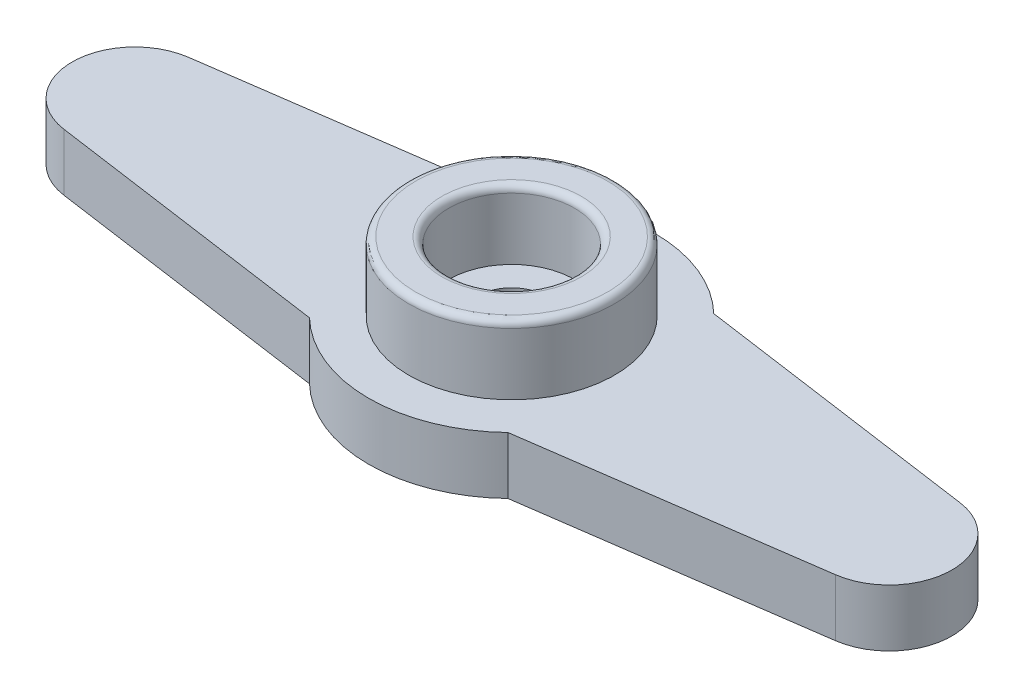
ISO-10303-21;
HEADER;
FILE_DESCRIPTION(('STEP AP214'),'2;1');
FILE_NAME('part.step','',(''),(''),'','','');
FILE_SCHEMA(('AUTOMOTIVE_DESIGN { 1 0 10303 214 1 1 1 1 }'));
ENDSEC;
DATA;
#1=APPLICATION_CONTEXT('core data for automotive mechanical design processes');
#2=APPLICATION_PROTOCOL_DEFINITION('international standard','automotive_design',2000,#1);
#3=PRODUCT_CONTEXT('',#1,'mechanical');
#4=PRODUCT('Part','Part','',(#3));
#5=PRODUCT_RELATED_PRODUCT_CATEGORY('part','',(#4));
#6=PRODUCT_DEFINITION_FORMATION('','',#4);
#7=PRODUCT_DEFINITION_CONTEXT('part definition',#1,'design');
#8=PRODUCT_DEFINITION('design','',#6,#7);
#9=PRODUCT_DEFINITION_SHAPE('','',#8);
#10=(LENGTH_UNIT() NAMED_UNIT(*) SI_UNIT(.MILLI.,.METRE.));
#11=(NAMED_UNIT(*) PLANE_ANGLE_UNIT() SI_UNIT($,.RADIAN.));
#12=(NAMED_UNIT(*) SI_UNIT($,.STERADIAN.) SOLID_ANGLE_UNIT());
#13=UNCERTAINTY_MEASURE_WITH_UNIT(LENGTH_MEASURE(1.E-05),#10,'distance_accuracy_value','');
#14=(GEOMETRIC_REPRESENTATION_CONTEXT(3) GLOBAL_UNCERTAINTY_ASSIGNED_CONTEXT((#13)) GLOBAL_UNIT_ASSIGNED_CONTEXT((#10,
#11,#12)) REPRESENTATION_CONTEXT('',''));
#15=CARTESIAN_POINT('',(0.,0.,0.));
#16=DIRECTION('',(0.,0.,1.));
#17=DIRECTION('',(1.,0.,0.));
#18=AXIS2_PLACEMENT_3D('',#15,#16,#17);
#19=CARTESIAN_POINT('',(16.5,0.,0.));
#20=DIRECTION('',(0.,1.,0.));
#21=DIRECTION('',(0.,0.,1.));
#22=AXIS2_PLACEMENT_3D('',#19,#20,#21);
#23=PLANE('',#22);
#24=CARTESIAN_POINT('',(0.,0.,0.));
#25=DIRECTION('',(0.,1.,0.));
#26=DIRECTION('',(0.,0.,1.));
#27=AXIS2_PLACEMENT_3D('',#24,#25,#26);
#28=CIRCLE('',#27,3.1);
#29=CARTESIAN_POINT('',(0.,0.,3.1));
#30=VERTEX_POINT('',#29);
#31=EDGE_CURVE('E184',#30,#30,#28,.T.);
#32=ORIENTED_EDGE('',*,*,#31,.T.);
#33=EDGE_LOOP('',(#32));
#34=FACE_BOUND('',#33,.T.);
#35=CARTESIAN_POINT('',(0.,0.,0.));
#36=DIRECTION('',(0.,1.,0.));
#37=DIRECTION('',(0.,0.,1.));
#38=AXIS2_PLACEMENT_3D('',#35,#36,#37);
#39=CIRCLE('',#38,3.2);
#40=CARTESIAN_POINT('',(0.,0.,3.2));
#41=VERTEX_POINT('',#40);
#42=EDGE_CURVE('E181',#41,#41,#39,.F.);
#43=ORIENTED_EDGE('',*,*,#42,.T.);
#44=EDGE_LOOP('',(#43));
#45=FACE_BOUND('',#44,.T.);
#46=ADVANCED_FACE('F35',(#34,#45),#23,.F.);
#47=CARTESIAN_POINT('',(16.5,2.5,0.));
#48=DIRECTION('',(0.,1.,0.));
#49=DIRECTION('',(0.,0.,1.));
#50=AXIS2_PLACEMENT_3D('',#47,#48,#49);
#51=PLANE('',#50);
#52=CARTESIAN_POINT('',(16.5,2.5,0.));
#53=DIRECTION('',(0.,1.,0.));
#54=DIRECTION('',(0.,0.,1.));
#55=AXIS2_PLACEMENT_3D('',#52,#53,#54);
#56=CIRCLE('',#55,2.75);
#57=CARTESIAN_POINT('',(16.8856250223403,2.5,2.72282818814281));
#58=VERTEX_POINT('',#57);
#59=CARTESIAN_POINT('',(16.8856250223403,2.5,-2.72282818814281));
#60=VERTEX_POINT('',#59);
#61=EDGE_CURVE('E149',#58,#60,#56,.T.);
#62=ORIENTED_EDGE('',*,*,#61,.T.);
#63=DIRECTION('',(-0.99011934114284,0.,-0.140227280851011));
#64=VECTOR('',#63,1.);
#65=CARTESIAN_POINT('',(16.8856250223403,2.5,-2.72282818814281));
#66=LINE('',#65,#64);
#67=CARTESIAN_POINT('',(4.33733789322437,2.5,-4.5));
#68=VERTEX_POINT('',#67);
#69=EDGE_CURVE('E96',#60,#68,#66,.T.);
#70=ORIENTED_EDGE('',*,*,#69,.T.);
#71=CARTESIAN_POINT('',(0.,2.5,0.));
#72=DIRECTION('',(0.,1.,0.));
#73=DIRECTION('',(0.,0.,1.));
#74=AXIS2_PLACEMENT_3D('',#71,#72,#73);
#75=CIRCLE('',#74,6.25);
#76=CARTESIAN_POINT('',(-4.34263185422694,2.5,-4.49489138674712));
#77=VERTEX_POINT('',#76);
#78=EDGE_CURVE('E253',#68,#77,#75,.T.);
#79=ORIENTED_EDGE('',*,*,#78,.T.);
#80=DIRECTION('',(-0.99011934114284,0.,0.140227280851011));
#81=VECTOR('',#80,1.);
#82=CARTESIAN_POINT('',(-16.8548479937508,2.5,-2.72282818814281));
#83=LINE('',#82,#81);
#84=CARTESIAN_POINT('',(-16.8548479937508,2.5,-2.72282818814281));
#85=VERTEX_POINT('',#84);
#86=EDGE_CURVE('E259',#77,#85,#83,.T.);
#87=ORIENTED_EDGE('',*,*,#86,.T.);
#88=CARTESIAN_POINT('',(-16.4692229714106,2.5,0.));
#89=DIRECTION('',(0.,1.,0.));
#90=DIRECTION('',(0.,0.,1.));
#91=AXIS2_PLACEMENT_3D('',#88,#89,#90);
#92=CIRCLE('',#91,2.75);
#93=CARTESIAN_POINT('',(-16.8548479937508,2.5,2.72282818814281));
#94=VERTEX_POINT('',#93);
#95=EDGE_CURVE('E116',#85,#94,#92,.T.);
#96=ORIENTED_EDGE('',*,*,#95,.T.);
#97=DIRECTION('',(0.99011934114284,0.,0.140227280851011));
#98=VECTOR('',#97,1.);
#99=CARTESIAN_POINT('',(-16.8548479937508,2.5,2.72282818814281));
#100=LINE('',#99,#98);
#101=CARTESIAN_POINT('',(-4.34263185422694,2.5,4.49489138674712));
#102=VERTEX_POINT('',#101);
#103=EDGE_CURVE('E109',#94,#102,#100,.T.);
#104=ORIENTED_EDGE('',*,*,#103,.T.);
#105=CARTESIAN_POINT('',(0.,2.5,0.));
#106=DIRECTION('',(0.,1.,0.));
#107=DIRECTION('',(0.,0.,1.));
#108=AXIS2_PLACEMENT_3D('',#105,#106,#107);
#109=CIRCLE('',#108,6.25);
#110=CARTESIAN_POINT('',(4.33733789322437,2.5,4.5));
#111=VERTEX_POINT('',#110);
#112=EDGE_CURVE('E114',#102,#111,#109,.T.);
#113=ORIENTED_EDGE('',*,*,#112,.T.);
#114=DIRECTION('',(0.99011934114284,0.,-0.140227280851011));
#115=VECTOR('',#114,1.);
#116=CARTESIAN_POINT('',(16.8856250223403,2.5,2.72282818814281));
#117=LINE('',#116,#115);
#118=EDGE_CURVE('E52',#111,#58,#117,.T.);
#119=ORIENTED_EDGE('',*,*,#118,.T.);
#120=EDGE_LOOP('',(#62,#70,#79,#87,#96,#104,#113,#119));
#121=FACE_BOUND('',#120,.T.);
#122=CARTESIAN_POINT('',(0.,2.5,0.));
#123=DIRECTION('',(0.,1.,0.));
#124=DIRECTION('',(0.,0.,1.));
#125=AXIS2_PLACEMENT_3D('',#122,#123,#124);
#126=CIRCLE('',#125,4.5);
#127=CARTESIAN_POINT('',(0.,2.5,4.5));
#128=VERTEX_POINT('',#127);
#129=EDGE_CURVE('E138',#128,#128,#126,.T.);
#130=ORIENTED_EDGE('',*,*,#129,.F.);
#131=EDGE_LOOP('',(#130));
#132=FACE_BOUND('',#131,.T.);
#133=ADVANCED_FACE('F111',(#121,#132),#51,.T.);
#134=CARTESIAN_POINT('',(16.5,2.5,0.));
#135=DIRECTION('',(0.,-1.,0.));
#136=DIRECTION('',(0.,0.,-1.));
#137=AXIS2_PLACEMENT_3D('',#134,#135,#136);
#138=CYLINDRICAL_SURFACE('',#137,2.75);
#139=CARTESIAN_POINT('',(16.5,0.,0.));
#140=DIRECTION('',(0.,1.,0.));
#141=DIRECTION('',(0.,0.,1.));
#142=AXIS2_PLACEMENT_3D('',#139,#140,#141);
#143=CIRCLE('',#142,2.75);
#144=CARTESIAN_POINT('',(16.8856250223403,0.,2.72282818814281));
#145=VERTEX_POINT('',#144);
#146=CARTESIAN_POINT('',(16.8856250223403,0.,-2.72282818814281));
#147=VERTEX_POINT('',#146);
#148=EDGE_CURVE('E134',#145,#147,#143,.T.);
#149=ORIENTED_EDGE('',*,*,#148,.T.);
#150=DIRECTION('',(0.,-1.,0.));
#151=VECTOR('',#150,1.);
#152=CARTESIAN_POINT('',(16.8856250223403,2.5,-2.72282818814281));
#153=LINE('',#152,#151);
#154=EDGE_CURVE('E162',#60,#147,#153,.T.);
#155=ORIENTED_EDGE('',*,*,#154,.F.);
#156=ORIENTED_EDGE('',*,*,#61,.F.);
#157=DIRECTION('',(0.,-1.,0.));
#158=VECTOR('',#157,1.);
#159=CARTESIAN_POINT('',(16.8856250223403,2.5,2.72282818814281));
#160=LINE('',#159,#158);
#161=EDGE_CURVE('E130',#58,#145,#160,.T.);
#162=ORIENTED_EDGE('',*,*,#161,.T.);
#163=EDGE_LOOP('',(#149,#155,#156,#162));
#164=FACE_BOUND('',#163,.T.);
#165=ADVANCED_FACE('F229',(#164),#138,.T.);
#166=CARTESIAN_POINT('',(16.8856250223403,2.5,-2.72282818814281));
#167=DIRECTION('',(-0.140227280851011,0.,0.99011934114284));
#168=DIRECTION('',(0.99011934114284,0.,0.140227280851011));
#169=AXIS2_PLACEMENT_3D('',#166,#167,#168);
#170=PLANE('',#169);
#171=DIRECTION('',(-0.99011934114284,0.,-0.140227280851011));
#172=VECTOR('',#171,1.);
#173=CARTESIAN_POINT('',(16.8856250223403,0.,-2.72282818814281));
#174=LINE('',#173,#172);
#175=CARTESIAN_POINT('',(4.33733789322437,0.,-4.5));
#176=VERTEX_POINT('',#175);
#177=EDGE_CURVE('E137',#147,#176,#174,.T.);
#178=ORIENTED_EDGE('',*,*,#177,.T.);
#179=DIRECTION('',(0.,-1.,0.));
#180=VECTOR('',#179,1.);
#181=CARTESIAN_POINT('',(4.33733789322437,2.5,-4.5));
#182=LINE('',#181,#180);
#183=EDGE_CURVE('E159',#68,#176,#182,.T.);
#184=ORIENTED_EDGE('',*,*,#183,.F.);
#185=ORIENTED_EDGE('',*,*,#69,.F.);
#186=ORIENTED_EDGE('',*,*,#154,.T.);
#187=EDGE_LOOP('',(#178,#184,#185,#186));
#188=FACE_BOUND('',#187,.T.);
#189=ADVANCED_FACE('F272',(#188),#170,.F.);
#190=CARTESIAN_POINT('',(0.,2.5,0.));
#191=DIRECTION('',(0.,-1.,0.));
#192=DIRECTION('',(0.,0.,-1.));
#193=AXIS2_PLACEMENT_3D('',#190,#191,#192);
#194=CYLINDRICAL_SURFACE('',#193,6.25);
#195=CARTESIAN_POINT('',(0.,0.,0.));
#196=DIRECTION('',(0.,1.,0.));
#197=DIRECTION('',(0.,0.,1.));
#198=AXIS2_PLACEMENT_3D('',#195,#196,#197);
#199=CIRCLE('',#198,6.25);
#200=CARTESIAN_POINT('',(-4.34263185422694,0.,-4.49489138674712));
#201=VERTEX_POINT('',#200);
#202=EDGE_CURVE('E140',#176,#201,#199,.T.);
#203=ORIENTED_EDGE('',*,*,#202,.T.);
#204=DIRECTION('',(0.,-1.,0.));
#205=VECTOR('',#204,1.);
#206=CARTESIAN_POINT('',(-4.34263185422694,2.5,-4.49489138674712));
#207=LINE('',#206,#205);
#208=EDGE_CURVE('E156',#77,#201,#207,.T.);
#209=ORIENTED_EDGE('',*,*,#208,.F.);
#210=ORIENTED_EDGE('',*,*,#78,.F.);
#211=ORIENTED_EDGE('',*,*,#183,.T.);
#212=EDGE_LOOP('',(#203,#209,#210,#211));
#213=FACE_BOUND('',#212,.T.);
#214=ADVANCED_FACE('F271',(#213),#194,.T.);
#215=CARTESIAN_POINT('',(-16.8548479937508,2.5,-2.72282818814281));
#216=DIRECTION('',(0.140227280851011,0.,0.99011934114284));
#217=DIRECTION('',(0.99011934114284,0.,-0.140227280851011));
#218=AXIS2_PLACEMENT_3D('',#215,#216,#217);
#219=PLANE('',#218);
#220=DIRECTION('',(-0.99011934114284,0.,0.140227280851011));
#221=VECTOR('',#220,1.);
#222=CARTESIAN_POINT('',(-16.8548479937508,0.,-2.72282818814281));
#223=LINE('',#222,#221);
#224=CARTESIAN_POINT('',(-16.8548479937508,0.,-2.72282818814281));
#225=VERTEX_POINT('',#224);
#226=EDGE_CURVE('E142',#201,#225,#223,.T.);
#227=ORIENTED_EDGE('',*,*,#226,.T.);
#228=DIRECTION('',(0.,-1.,0.));
#229=VECTOR('',#228,1.);
#230=CARTESIAN_POINT('',(-16.8548479937508,2.5,-2.72282818814281));
#231=LINE('',#230,#229);
#232=EDGE_CURVE('E153',#85,#225,#231,.T.);
#233=ORIENTED_EDGE('',*,*,#232,.F.);
#234=ORIENTED_EDGE('',*,*,#86,.F.);
#235=ORIENTED_EDGE('',*,*,#208,.T.);
#236=EDGE_LOOP('',(#227,#233,#234,#235));
#237=FACE_BOUND('',#236,.T.);
#238=ADVANCED_FACE('F265',(#237),#219,.F.);
#239=CARTESIAN_POINT('',(-16.4692229714106,2.5,0.));
#240=DIRECTION('',(0.,-1.,0.));
#241=DIRECTION('',(0.,0.,-1.));
#242=AXIS2_PLACEMENT_3D('',#239,#240,#241);
#243=CYLINDRICAL_SURFACE('',#242,2.75);
#244=CARTESIAN_POINT('',(-16.4692229714106,0.,0.));
#245=DIRECTION('',(0.,1.,0.));
#246=DIRECTION('',(0.,0.,1.));
#247=AXIS2_PLACEMENT_3D('',#244,#245,#246);
#248=CIRCLE('',#247,2.75);
#249=CARTESIAN_POINT('',(-16.8548479937508,0.,2.72282818814281));
#250=VERTEX_POINT('',#249);
#251=EDGE_CURVE('E144',#225,#250,#248,.T.);
#252=ORIENTED_EDGE('',*,*,#251,.T.);
#253=DIRECTION('',(0.,-1.,0.));
#254=VECTOR('',#253,1.);
#255=CARTESIAN_POINT('',(-16.8548479937508,2.5,2.72282818814281));
#256=LINE('',#255,#254);
#257=EDGE_CURVE('E125',#94,#250,#256,.T.);
#258=ORIENTED_EDGE('',*,*,#257,.F.);
#259=ORIENTED_EDGE('',*,*,#95,.F.);
#260=ORIENTED_EDGE('',*,*,#232,.T.);
#261=EDGE_LOOP('',(#252,#258,#259,#260));
#262=FACE_BOUND('',#261,.T.);
#263=ADVANCED_FACE('F269',(#262),#243,.T.);
#264=CARTESIAN_POINT('',(-16.8548479937508,2.5,2.72282818814281));
#265=DIRECTION('',(0.140227280851011,0.,-0.99011934114284));
#266=DIRECTION('',(-0.99011934114284,0.,-0.140227280851011));
#267=AXIS2_PLACEMENT_3D('',#264,#265,#266);
#268=PLANE('',#267);
#269=DIRECTION('',(0.99011934114284,0.,0.140227280851011));
#270=VECTOR('',#269,1.);
#271=CARTESIAN_POINT('',(-16.8548479937508,0.,2.72282818814281));
#272=LINE('',#271,#270);
#273=CARTESIAN_POINT('',(-4.34263185422694,0.,4.49489138674712));
#274=VERTEX_POINT('',#273);
#275=EDGE_CURVE('E124',#250,#274,#272,.T.);
#276=ORIENTED_EDGE('',*,*,#275,.T.);
#277=DIRECTION('',(0.,-1.,0.));
#278=VECTOR('',#277,1.);
#279=CARTESIAN_POINT('',(-4.34263185422694,2.5,4.49489138674712));
#280=LINE('',#279,#278);
#281=EDGE_CURVE('E121',#102,#274,#280,.T.);
#282=ORIENTED_EDGE('',*,*,#281,.F.);
#283=ORIENTED_EDGE('',*,*,#103,.F.);
#284=ORIENTED_EDGE('',*,*,#257,.T.);
#285=EDGE_LOOP('',(#276,#282,#283,#284));
#286=FACE_BOUND('',#285,.T.);
#287=ADVANCED_FACE('F122',(#286),#268,.F.);
#288=CARTESIAN_POINT('',(0.,2.5,0.));
#289=DIRECTION('',(0.,-1.,0.));
#290=DIRECTION('',(0.,0.,-1.));
#291=AXIS2_PLACEMENT_3D('',#288,#289,#290);
#292=CYLINDRICAL_SURFACE('',#291,6.25);
#293=CARTESIAN_POINT('',(0.,0.,0.));
#294=DIRECTION('',(0.,1.,0.));
#295=DIRECTION('',(0.,0.,1.));
#296=AXIS2_PLACEMENT_3D('',#293,#294,#295);
#297=CIRCLE('',#296,6.25);
#298=CARTESIAN_POINT('',(4.33733789322437,0.,4.5));
#299=VERTEX_POINT('',#298);
#300=EDGE_CURVE('E81',#274,#299,#297,.T.);
#301=ORIENTED_EDGE('',*,*,#300,.T.);
#302=DIRECTION('',(0.,-1.,0.));
#303=VECTOR('',#302,1.);
#304=CARTESIAN_POINT('',(4.33733789322437,2.5,4.5));
#305=LINE('',#304,#303);
#306=EDGE_CURVE('E126',#111,#299,#305,.T.);
#307=ORIENTED_EDGE('',*,*,#306,.F.);
#308=ORIENTED_EDGE('',*,*,#112,.F.);
#309=ORIENTED_EDGE('',*,*,#281,.T.);
#310=EDGE_LOOP('',(#301,#307,#308,#309));
#311=FACE_BOUND('',#310,.T.);
#312=ADVANCED_FACE('F128',(#311),#292,.T.);
#313=CARTESIAN_POINT('',(16.8856250223403,2.5,2.72282818814281));
#314=DIRECTION('',(-0.140227280851011,0.,-0.99011934114284));
#315=DIRECTION('',(-0.99011934114284,0.,0.140227280851011));
#316=AXIS2_PLACEMENT_3D('',#313,#314,#315);
#317=PLANE('',#316);
#318=DIRECTION('',(0.99011934114284,0.,-0.140227280851011));
#319=VECTOR('',#318,1.);
#320=CARTESIAN_POINT('',(16.8856250223403,0.,2.72282818814281));
#321=LINE('',#320,#319);
#322=EDGE_CURVE('E87',#299,#145,#321,.T.);
#323=ORIENTED_EDGE('',*,*,#322,.T.);
#324=ORIENTED_EDGE('',*,*,#161,.F.);
#325=ORIENTED_EDGE('',*,*,#118,.F.);
#326=ORIENTED_EDGE('',*,*,#306,.T.);
#327=EDGE_LOOP('',(#323,#324,#325,#326));
#328=FACE_BOUND('',#327,.T.);
#329=ADVANCED_FACE('F238',(#328),#317,.F.);
#330=CARTESIAN_POINT('',(0.,0.,0.));
#331=DIRECTION('',(0.,1.,0.));
#332=DIRECTION('',(0.,0.,1.));
#333=AXIS2_PLACEMENT_3D('',#330,#331,#332);
#334=CIRCLE('',#333,4.8);
#335=CARTESIAN_POINT('',(0.,0.,4.8));
#336=VERTEX_POINT('',#335);
#337=EDGE_CURVE('E175',#336,#336,#334,.T.);
#338=ORIENTED_EDGE('',*,*,#337,.T.);
#339=EDGE_LOOP('',(#338));
#340=FACE_BOUND('',#339,.T.);
#341=ORIENTED_EDGE('',*,*,#148,.F.);
#342=ORIENTED_EDGE('',*,*,#322,.F.);
#343=ORIENTED_EDGE('',*,*,#300,.F.);
#344=ORIENTED_EDGE('',*,*,#275,.F.);
#345=ORIENTED_EDGE('',*,*,#251,.F.);
#346=ORIENTED_EDGE('',*,*,#226,.F.);
#347=ORIENTED_EDGE('',*,*,#202,.F.);
#348=ORIENTED_EDGE('',*,*,#177,.F.);
#349=EDGE_LOOP('',(#341,#342,#343,#344,#345,#346,#347,#348));
#350=FACE_BOUND('',#349,.T.);
#351=ADVANCED_FACE('F232',(#340,#350),#23,.F.);
#352=CARTESIAN_POINT('',(0.,5.5,0.));
#353=DIRECTION('',(0.,1.,0.));
#354=DIRECTION('',(0.,0.,1.));
#355=AXIS2_PLACEMENT_3D('',#352,#353,#354);
#356=PLANE('',#355);
#357=CARTESIAN_POINT('',(0.,5.5,0.));
#358=DIRECTION('',(0.,1.,0.));
#359=DIRECTION('',(0.,0.,1.));
#360=AXIS2_PLACEMENT_3D('',#357,#358,#359);
#361=CIRCLE('',#360,3.05);
#362=CARTESIAN_POINT('',(0.,5.5,3.05));
#363=VERTEX_POINT('',#362);
#364=EDGE_CURVE('E44',#363,#363,#361,.F.);
#365=ORIENTED_EDGE('',*,*,#364,.T.);
#366=EDGE_LOOP('',(#365));
#367=FACE_BOUND('',#366,.T.);
#368=CARTESIAN_POINT('',(0.,5.5,0.));
#369=DIRECTION('',(0.,1.,0.));
#370=DIRECTION('',(0.,0.,1.));
#371=AXIS2_PLACEMENT_3D('',#368,#369,#370);
#372=CIRCLE('',#371,4.2);
#373=CARTESIAN_POINT('',(0.,5.5,4.2));
#374=VERTEX_POINT('',#373);
#375=EDGE_CURVE('E193',#374,#374,#372,.T.);
#376=ORIENTED_EDGE('',*,*,#375,.T.);
#377=EDGE_LOOP('',(#376));
#378=FACE_BOUND('',#377,.T.);
#379=ADVANCED_FACE('F198',(#367,#378),#356,.T.);
#380=CARTESIAN_POINT('',(0.,5.5,0.));
#381=DIRECTION('',(0.,-1.,0.));
#382=DIRECTION('',(0.,0.,-1.));
#383=AXIS2_PLACEMENT_3D('',#380,#381,#382);
#384=CYLINDRICAL_SURFACE('',#383,4.5);
#385=CARTESIAN_POINT('',(0.,5.2,0.));
#386=DIRECTION('',(0.,1.,0.));
#387=DIRECTION('',(0.,0.,1.));
#388=AXIS2_PLACEMENT_3D('',#385,#386,#387);
#389=CIRCLE('',#388,4.5);
#390=CARTESIAN_POINT('',(0.,5.2,4.5));
#391=VERTEX_POINT('',#390);
#392=EDGE_CURVE('E12',#391,#391,#389,.F.);
#393=ORIENTED_EDGE('',*,*,#392,.T.);
#394=EDGE_LOOP('',(#393));
#395=FACE_BOUND('',#394,.T.);
#396=ORIENTED_EDGE('',*,*,#129,.T.);
#397=EDGE_LOOP('',(#396));
#398=FACE_BOUND('',#397,.T.);
#399=ADVANCED_FACE('F211',(#395,#398),#384,.T.);
#400=CARTESIAN_POINT('',(0.,5.5,0.));
#401=DIRECTION('',(0.,-1.,0.));
#402=DIRECTION('',(0.,0.,-1.));
#403=AXIS2_PLACEMENT_3D('',#400,#401,#402);
#404=CYLINDRICAL_SURFACE('',#403,2.75);
#405=CARTESIAN_POINT('',(0.,5.2,0.));
#406=DIRECTION('',(0.,1.,0.));
#407=DIRECTION('',(0.,0.,1.));
#408=AXIS2_PLACEMENT_3D('',#405,#406,#407);
#409=CIRCLE('',#408,2.75);
#410=CARTESIAN_POINT('',(0.,5.2,2.75));
#411=VERTEX_POINT('',#410);
#412=EDGE_CURVE('E190',#411,#411,#409,.T.);
#413=ORIENTED_EDGE('',*,*,#412,.T.);
#414=EDGE_LOOP('',(#413));
#415=FACE_BOUND('',#414,.T.);
#416=CARTESIAN_POINT('',(0.,2.5,0.));
#417=DIRECTION('',(0.,1.,0.));
#418=DIRECTION('',(0.,0.,1.));
#419=AXIS2_PLACEMENT_3D('',#416,#417,#418);
#420=CIRCLE('',#419,2.75);
#421=CARTESIAN_POINT('',(0.,2.5,2.75));
#422=VERTEX_POINT('',#421);
#423=EDGE_CURVE('E164',#422,#422,#420,.F.);
#424=ORIENTED_EDGE('',*,*,#423,.T.);
#425=EDGE_LOOP('',(#424));
#426=FACE_BOUND('',#425,.T.);
#427=ADVANCED_FACE('F207',(#415,#426),#404,.F.);
#428=CARTESIAN_POINT('',(0.,2.5,0.));
#429=DIRECTION('',(0.,1.,0.));
#430=DIRECTION('',(0.,0.,1.));
#431=AXIS2_PLACEMENT_3D('',#428,#429,#430);
#432=CIRCLE('',#431,1.5);
#433=CARTESIAN_POINT('',(0.,2.5,1.5));
#434=VERTEX_POINT('',#433);
#435=EDGE_CURVE('E171',#434,#434,#432,.F.);
#436=ORIENTED_EDGE('',*,*,#435,.T.);
#437=EDGE_LOOP('',(#436));
#438=FACE_BOUND('',#437,.T.);
#439=ORIENTED_EDGE('',*,*,#423,.F.);
#440=EDGE_LOOP('',(#439));
#441=FACE_BOUND('',#440,.T.);
#442=ADVANCED_FACE('F210',(#438,#441),#51,.T.);
#443=CARTESIAN_POINT('',(0.,5.501,0.));
#444=DIRECTION('',(0.,-1.,0.));
#445=DIRECTION('',(0.,0.,-1.));
#446=AXIS2_PLACEMENT_3D('',#443,#444,#445);
#447=CYLINDRICAL_SURFACE('',#446,1.5);
#448=CARTESIAN_POINT('',(0.,1.,0.));
#449=DIRECTION('',(0.,1.,0.));
#450=DIRECTION('',(0.,0.,1.));
#451=AXIS2_PLACEMENT_3D('',#448,#449,#450);
#452=CIRCLE('',#451,1.5);
#453=CARTESIAN_POINT('',(0.,1.,1.5));
#454=VERTEX_POINT('',#453);
#455=EDGE_CURVE('E168',#454,#454,#452,.F.);
#456=ORIENTED_EDGE('',*,*,#455,.T.);
#457=EDGE_LOOP('',(#456));
#458=FACE_BOUND('',#457,.T.);
#459=ORIENTED_EDGE('',*,*,#435,.F.);
#460=EDGE_LOOP('',(#459));
#461=FACE_BOUND('',#460,.T.);
#462=ADVANCED_FACE('F216',(#458,#461),#447,.F.);
#463=CARTESIAN_POINT('',(16.5,1.,0.));
#464=DIRECTION('',(0.,1.,0.));
#465=DIRECTION('',(0.,0.,1.));
#466=AXIS2_PLACEMENT_3D('',#463,#464,#465);
#467=PLANE('',#466);
#468=CARTESIAN_POINT('',(0.,0.999999999999999,0.));
#469=DIRECTION('',(0.,1.,0.));
#470=DIRECTION('',(0.,0.,1.));
#471=AXIS2_PLACEMENT_3D('',#468,#469,#470);
#472=CIRCLE('',#471,2.8);
#473=CARTESIAN_POINT('',(0.,0.999999999999999,2.8));
#474=VERTEX_POINT('',#473);
#475=EDGE_CURVE('E172',#474,#474,#472,.F.);
#476=ORIENTED_EDGE('',*,*,#475,.T.);
#477=EDGE_LOOP('',(#476));
#478=FACE_BOUND('',#477,.T.);
#479=ORIENTED_EDGE('',*,*,#455,.F.);
#480=EDGE_LOOP('',(#479));
#481=FACE_BOUND('',#480,.T.);
#482=ADVANCED_FACE('F222',(#478,#481),#467,.F.);
#483=CARTESIAN_POINT('',(0.,10.4195959492893,0.));
#484=DIRECTION('',(0.,-1.,0.));
#485=DIRECTION('',(0.,0.,-1.));
#486=AXIS2_PLACEMENT_3D('',#483,#484,#485);
#487=CYLINDRICAL_SURFACE('',#486,2.8);
#488=CARTESIAN_POINT('',(0.,0.3,0.));
#489=DIRECTION('',(0.,1.,0.));
#490=DIRECTION('',(0.,0.,1.));
#491=AXIS2_PLACEMENT_3D('',#488,#489,#490);
#492=CIRCLE('',#491,2.8);
#493=CARTESIAN_POINT('',(0.,0.3,2.8));
#494=VERTEX_POINT('',#493);
#495=EDGE_CURVE('E178',#494,#494,#492,.F.);
#496=ORIENTED_EDGE('',*,*,#495,.T.);
#497=EDGE_LOOP('',(#496));
#498=FACE_BOUND('',#497,.T.);
#499=ORIENTED_EDGE('',*,*,#475,.F.);
#500=EDGE_LOOP('',(#499));
#501=FACE_BOUND('',#500,.T.);
#502=ADVANCED_FACE('F325',(#498,#501),#487,.F.);
#503=CARTESIAN_POINT('',(0.,0.5,0.));
#504=DIRECTION('',(0.,-1.,0.));
#505=DIRECTION('',(0.,0.,-1.));
#506=AXIS2_PLACEMENT_3D('',#503,#504,#505);
#507=CYLINDRICAL_SURFACE('',#506,4.5);
#508=CARTESIAN_POINT('',(0.,0.3,0.));
#509=DIRECTION('',(0.,1.,0.));
#510=DIRECTION('',(0.,0.,1.));
#511=AXIS2_PLACEMENT_3D('',#508,#509,#510);
#512=CIRCLE('',#511,4.5);
#513=CARTESIAN_POINT('',(0.,0.3,4.5));
#514=VERTEX_POINT('',#513);
#515=EDGE_CURVE('E167',#514,#514,#512,.F.);
#516=ORIENTED_EDGE('',*,*,#515,.T.);
#517=EDGE_LOOP('',(#516));
#518=FACE_BOUND('',#517,.T.);
#519=CARTESIAN_POINT('',(0.,0.5,0.));
#520=DIRECTION('',(0.,-1.,0.));
#521=DIRECTION('',(0.,0.,-1.));
#522=AXIS2_PLACEMENT_3D('',#519,#520,#521);
#523=CIRCLE('',#522,4.5);
#524=CARTESIAN_POINT('',(0.,0.5,-4.5));
#525=VERTEX_POINT('',#524);
#526=EDGE_CURVE('E308',#525,#525,#523,.T.);
#527=ORIENTED_EDGE('',*,*,#526,.F.);
#528=EDGE_LOOP('',(#527));
#529=FACE_BOUND('',#528,.T.);
#530=ADVANCED_FACE('F329',(#518,#529),#507,.F.);
#531=CARTESIAN_POINT('',(0.,0.5,0.));
#532=DIRECTION('',(0.,-1.,0.));
#533=DIRECTION('',(0.,0.,-1.));
#534=AXIS2_PLACEMENT_3D('',#531,#532,#533);
#535=PLANE('',#534);
#536=CARTESIAN_POINT('',(0.,0.5,0.));
#537=DIRECTION('',(0.,-1.,0.));
#538=DIRECTION('',(0.,0.,-1.));
#539=AXIS2_PLACEMENT_3D('',#536,#537,#538);
#540=CIRCLE('',#539,3.5);
#541=CARTESIAN_POINT('',(0.,0.5,-3.5));
#542=VERTEX_POINT('',#541);
#543=EDGE_CURVE('E306',#542,#542,#540,.T.);
#544=ORIENTED_EDGE('',*,*,#543,.F.);
#545=EDGE_LOOP('',(#544));
#546=FACE_BOUND('',#545,.T.);
#547=ORIENTED_EDGE('',*,*,#526,.T.);
#548=EDGE_LOOP('',(#547));
#549=FACE_BOUND('',#548,.T.);
#550=ADVANCED_FACE('F302',(#546,#549),#535,.T.);
#551=CARTESIAN_POINT('',(0.,0.5,0.));
#552=DIRECTION('',(0.,-1.,0.));
#553=DIRECTION('',(0.,0.,-1.));
#554=AXIS2_PLACEMENT_3D('',#551,#552,#553);
#555=CYLINDRICAL_SURFACE('',#554,3.5);
#556=CARTESIAN_POINT('',(0.,0.3,0.));
#557=DIRECTION('',(0.,1.,0.));
#558=DIRECTION('',(0.,0.,1.));
#559=AXIS2_PLACEMENT_3D('',#556,#557,#558);
#560=CIRCLE('',#559,3.5);
#561=CARTESIAN_POINT('',(0.,0.3,3.5));
#562=VERTEX_POINT('',#561);
#563=EDGE_CURVE('E187',#562,#562,#560,.T.);
#564=ORIENTED_EDGE('',*,*,#563,.T.);
#565=EDGE_LOOP('',(#564));
#566=FACE_BOUND('',#565,.T.);
#567=ORIENTED_EDGE('',*,*,#543,.T.);
#568=EDGE_LOOP('',(#567));
#569=FACE_BOUND('',#568,.T.);
#570=ADVANCED_FACE('F287',(#566,#569),#555,.T.);
#571=CARTESIAN_POINT('',(0.,0.3,0.));
#572=DIRECTION('',(0.,1.,0.));
#573=DIRECTION('',(0.,0.,1.));
#574=AXIS2_PLACEMENT_3D('',#571,#572,#573);
#575=TOROIDAL_SURFACE('',#574,4.8,0.3);
#576=ORIENTED_EDGE('',*,*,#337,.F.);
#577=EDGE_LOOP('',(#576));
#578=FACE_BOUND('',#577,.T.);
#579=ORIENTED_EDGE('',*,*,#515,.F.);
#580=EDGE_LOOP('',(#579));
#581=FACE_BOUND('',#580,.T.);
#582=ADVANCED_FACE('F283',(#578,#581),#575,.T.);
#583=CARTESIAN_POINT('',(0.,0.3,0.));
#584=DIRECTION('',(0.,1.,0.));
#585=DIRECTION('',(0.,0.,1.));
#586=AXIS2_PLACEMENT_3D('',#583,#584,#585);
#587=TOROIDAL_SURFACE('',#586,3.1,0.3);
#588=ORIENTED_EDGE('',*,*,#31,.F.);
#589=EDGE_LOOP('',(#588));
#590=FACE_BOUND('',#589,.T.);
#591=ORIENTED_EDGE('',*,*,#495,.F.);
#592=EDGE_LOOP('',(#591));
#593=FACE_BOUND('',#592,.T.);
#594=ADVANCED_FACE('F286',(#590,#593),#587,.T.);
#595=CARTESIAN_POINT('',(0.,0.3,0.));
#596=DIRECTION('',(0.,1.,0.));
#597=DIRECTION('',(0.,0.,1.));
#598=AXIS2_PLACEMENT_3D('',#595,#596,#597);
#599=TOROIDAL_SURFACE('',#598,3.2,0.3);
#600=ORIENTED_EDGE('',*,*,#563,.F.);
#601=EDGE_LOOP('',(#600));
#602=FACE_BOUND('',#601,.T.);
#603=ORIENTED_EDGE('',*,*,#42,.F.);
#604=EDGE_LOOP('',(#603));
#605=FACE_BOUND('',#604,.T.);
#606=ADVANCED_FACE('F204',(#602,#605),#599,.T.);
#607=CARTESIAN_POINT('',(0.,5.2,0.));
#608=DIRECTION('',(0.,1.,0.));
#609=DIRECTION('',(0.,0.,1.));
#610=AXIS2_PLACEMENT_3D('',#607,#608,#609);
#611=TOROIDAL_SURFACE('',#610,3.05,0.3);
#612=ORIENTED_EDGE('',*,*,#364,.F.);
#613=EDGE_LOOP('',(#612));
#614=FACE_BOUND('',#613,.T.);
#615=ORIENTED_EDGE('',*,*,#412,.F.);
#616=EDGE_LOOP('',(#615));
#617=FACE_BOUND('',#616,.T.);
#618=ADVANCED_FACE('F201',(#614,#617),#611,.T.);
#619=CARTESIAN_POINT('',(0.,5.2,0.));
#620=DIRECTION('',(0.,1.,0.));
#621=DIRECTION('',(0.,0.,1.));
#622=AXIS2_PLACEMENT_3D('',#619,#620,#621);
#623=TOROIDAL_SURFACE('',#622,4.2,0.3);
#624=ORIENTED_EDGE('',*,*,#392,.F.);
#625=EDGE_LOOP('',(#624));
#626=FACE_BOUND('',#625,.T.);
#627=ORIENTED_EDGE('',*,*,#375,.F.);
#628=EDGE_LOOP('',(#627));
#629=FACE_BOUND('',#628,.T.);
#630=ADVANCED_FACE('F37',(#626,#629),#623,.T.);
#631=CLOSED_SHELL('',(#46,#133,#165,#189,#214,#238,#263,#287,#312,#329,#351,#379,#399,#427,#442,
#462,#482,#502,#530,#550,#570,#582,#594,#606,#618,#630));
#632=MANIFOLD_SOLID_BREP('B2',#631);
#633=ADVANCED_BREP_SHAPE_REPRESENTATION('',(#18,#632),#14);
#634=SHAPE_DEFINITION_REPRESENTATION(#9,#633);
ENDSEC;
END-ISO-10303-21;
